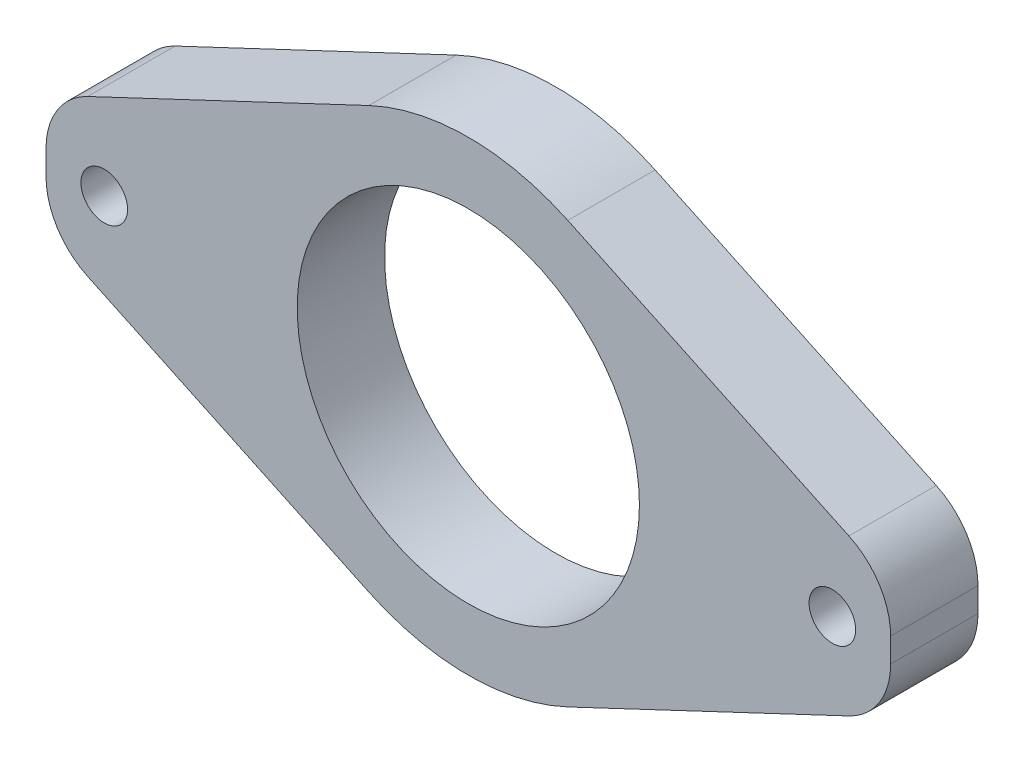
ISO-10303-21;
HEADER;
FILE_DESCRIPTION(('STEP AP214'),'2;1');
FILE_NAME('part.step','',(''),(''),'','','');
FILE_SCHEMA(('AUTOMOTIVE_DESIGN { 1 0 10303 214 1 1 1 1 }'));
ENDSEC;
DATA;
#1=APPLICATION_CONTEXT('core data for automotive mechanical design processes');
#2=APPLICATION_PROTOCOL_DEFINITION('international standard','automotive_design',2000,#1);
#3=PRODUCT_CONTEXT('',#1,'mechanical');
#4=PRODUCT('Part','Part','',(#3));
#5=PRODUCT_RELATED_PRODUCT_CATEGORY('part','',(#4));
#6=PRODUCT_DEFINITION_FORMATION('','',#4);
#7=PRODUCT_DEFINITION_CONTEXT('part definition',#1,'design');
#8=PRODUCT_DEFINITION('design','',#6,#7);
#9=PRODUCT_DEFINITION_SHAPE('','',#8);
#10=(LENGTH_UNIT() NAMED_UNIT(*) SI_UNIT(.MILLI.,.METRE.));
#11=(NAMED_UNIT(*) PLANE_ANGLE_UNIT() SI_UNIT($,.RADIAN.));
#12=(NAMED_UNIT(*) SI_UNIT($,.STERADIAN.) SOLID_ANGLE_UNIT());
#13=UNCERTAINTY_MEASURE_WITH_UNIT(LENGTH_MEASURE(1.E-05),#10,'distance_accuracy_value','');
#14=(GEOMETRIC_REPRESENTATION_CONTEXT(3) GLOBAL_UNCERTAINTY_ASSIGNED_CONTEXT((#13)) GLOBAL_UNIT_ASSIGNED_CONTEXT((#10,
#11,#12)) REPRESENTATION_CONTEXT('',''));
#15=CARTESIAN_POINT('',(0.,0.,0.));
#16=DIRECTION('',(0.,0.,1.));
#17=DIRECTION('',(1.,0.,0.));
#18=AXIS2_PLACEMENT_3D('',#15,#16,#17);
#19=CARTESIAN_POINT('',(0.,0.,6.));
#20=DIRECTION('',(0.,0.,-1.));
#21=DIRECTION('',(-1.,0.,0.));
#22=AXIS2_PLACEMENT_3D('',#19,#20,#21);
#23=CYLINDRICAL_SURFACE('',#22,16.);
#24=CARTESIAN_POINT('',(0.,0.,0.));
#25=DIRECTION('',(0.,0.,1.));
#26=DIRECTION('',(1.,0.,0.));
#27=AXIS2_PLACEMENT_3D('',#24,#25,#26);
#28=CIRCLE('',#27,16.);
#29=CARTESIAN_POINT('',(-6.83199616565601,14.4680277989939,0.));
#30=VERTEX_POINT('',#29);
#31=CARTESIAN_POINT('',(6.83199616565601,14.4680277989939,0.));
#32=VERTEX_POINT('',#31);
#33=EDGE_CURVE('E142',#30,#32,#28,.F.);
#34=ORIENTED_EDGE('',*,*,#33,.F.);
#35=DIRECTION('',(0.,0.,-1.));
#36=VECTOR('',#35,1.);
#37=CARTESIAN_POINT('',(-6.83199616565601,14.4680277989939,6.));
#38=LINE('',#37,#36);
#39=CARTESIAN_POINT('',(-6.83199616565601,14.4680277989939,6.));
#40=VERTEX_POINT('',#39);
#41=EDGE_CURVE('E130',#40,#30,#38,.T.);
#42=ORIENTED_EDGE('',*,*,#41,.F.);
#43=CARTESIAN_POINT('',(0.,0.,6.));
#44=DIRECTION('',(0.,0.,1.));
#45=DIRECTION('',(1.,0.,0.));
#46=AXIS2_PLACEMENT_3D('',#43,#44,#45);
#47=CIRCLE('',#46,16.);
#48=CARTESIAN_POINT('',(6.83199616565601,14.4680277989939,6.));
#49=VERTEX_POINT('',#48);
#50=EDGE_CURVE('E136',#40,#49,#47,.F.);
#51=ORIENTED_EDGE('',*,*,#50,.T.);
#52=DIRECTION('',(0.,0.,-1.));
#53=VECTOR('',#52,1.);
#54=CARTESIAN_POINT('',(6.83199616565601,14.4680277989939,6.));
#55=LINE('',#54,#53);
#56=EDGE_CURVE('E180',#49,#32,#55,.T.);
#57=ORIENTED_EDGE('',*,*,#56,.T.);
#58=EDGE_LOOP('',(#34,#42,#51,#57));
#59=FACE_BOUND('',#58,.T.);
#60=ADVANCED_FACE('F35',(#59),#23,.T.);
#61=CARTESIAN_POINT('',(-6.83199616565601,14.4680277989939,6.));
#62=DIRECTION('',(-0.4269997603535,0.904251737437122,0.));
#63=DIRECTION('',(-0.904251737437122,-0.426999760353501,0.));
#64=AXIS2_PLACEMENT_3D('',#61,#62,#63);
#65=PLANE('',#64);
#66=DIRECTION('',(0.904251737437122,0.426999760353501,0.));
#67=VECTOR('',#66,1.);
#68=CARTESIAN_POINT('',(-6.83199616565601,14.4680277989939,0.));
#69=LINE('',#68,#67);
#70=CARTESIAN_POINT('',(-26.1349988017675,5.35289187115644,0.));
#71=VERTEX_POINT('',#70);
#72=EDGE_CURVE('E182',#71,#30,#69,.T.);
#73=ORIENTED_EDGE('',*,*,#72,.F.);
#74=DIRECTION('',(0.,0.,-1.));
#75=VECTOR('',#74,1.);
#76=CARTESIAN_POINT('',(-26.1349988017675,5.35289187115644,6.));
#77=LINE('',#76,#75);
#78=CARTESIAN_POINT('',(-26.1349988017675,5.35289187115644,6.));
#79=VERTEX_POINT('',#78);
#80=EDGE_CURVE('E43',#71,#79,#77,.F.);
#81=ORIENTED_EDGE('',*,*,#80,.T.);
#82=DIRECTION('',(0.904251737437122,0.426999760353501,0.));
#83=VECTOR('',#82,1.);
#84=CARTESIAN_POINT('',(-6.83199616565601,14.4680277989939,6.));
#85=LINE('',#84,#83);
#86=EDGE_CURVE('E126',#79,#40,#85,.T.);
#87=ORIENTED_EDGE('',*,*,#86,.T.);
#88=ORIENTED_EDGE('',*,*,#41,.T.);
#89=EDGE_LOOP('',(#73,#81,#87,#88));
#90=FACE_BOUND('',#89,.T.);
#91=ADVANCED_FACE('F129',(#90),#65,.T.);
#92=CARTESIAN_POINT('',(-29.,0.,6.));
#93=DIRECTION('',(-1.,0.,0.));
#94=DIRECTION('',(0.,0.,1.));
#95=AXIS2_PLACEMENT_3D('',#92,#93,#94);
#96=PLANE('',#95);
#97=DIRECTION('',(0.,1.,0.));
#98=VECTOR('',#97,1.);
#99=CARTESIAN_POINT('',(-29.,0.,6.));
#100=LINE('',#99,#98);
#101=CARTESIAN_POINT('',(-29.,-0.831633183970833,6.));
#102=VERTEX_POINT('',#101);
#103=CARTESIAN_POINT('',(-29.,0.831633183970832,6.));
#104=VERTEX_POINT('',#103);
#105=EDGE_CURVE('E135',#102,#104,#100,.T.);
#106=ORIENTED_EDGE('',*,*,#105,.T.);
#107=DIRECTION('',(0.,0.,-1.));
#108=VECTOR('',#107,1.);
#109=CARTESIAN_POINT('',(-29.,0.831633183970832,6.));
#110=LINE('',#109,#108);
#111=CARTESIAN_POINT('',(-29.,0.831633183970832,0.));
#112=VERTEX_POINT('',#111);
#113=EDGE_CURVE('E235',#104,#112,#110,.T.);
#114=ORIENTED_EDGE('',*,*,#113,.T.);
#115=DIRECTION('',(0.,1.,0.));
#116=VECTOR('',#115,1.);
#117=CARTESIAN_POINT('',(-29.,0.,0.));
#118=LINE('',#117,#116);
#119=CARTESIAN_POINT('',(-29.,-0.831633183970833,0.));
#120=VERTEX_POINT('',#119);
#121=EDGE_CURVE('E184',#120,#112,#118,.T.);
#122=ORIENTED_EDGE('',*,*,#121,.F.);
#123=DIRECTION('',(0.,0.,-1.));
#124=VECTOR('',#123,1.);
#125=CARTESIAN_POINT('',(-29.,-0.831633183970833,6.));
#126=LINE('',#125,#124);
#127=EDGE_CURVE('E233',#120,#102,#126,.F.);
#128=ORIENTED_EDGE('',*,*,#127,.T.);
#129=EDGE_LOOP('',(#106,#114,#122,#128));
#130=FACE_BOUND('',#129,.T.);
#131=ADVANCED_FACE('F240',(#130),#96,.T.);
#132=CARTESIAN_POINT('',(-6.83199616565601,-14.4680277989939,6.));
#133=DIRECTION('',(0.4269997603535,0.904251737437122,0.));
#134=DIRECTION('',(-0.904251737437122,0.426999760353501,0.));
#135=AXIS2_PLACEMENT_3D('',#132,#133,#134);
#136=PLANE('',#135);
#137=DIRECTION('',(0.904251737437122,-0.426999760353501,0.));
#138=VECTOR('',#137,1.);
#139=CARTESIAN_POINT('',(-6.83199616565601,-14.4680277989939,6.));
#140=LINE('',#139,#138);
#141=CARTESIAN_POINT('',(-26.1349988017675,-5.35289187115644,6.));
#142=VERTEX_POINT('',#141);
#143=CARTESIAN_POINT('',(-6.83199616565601,-14.4680277989939,6.));
#144=VERTEX_POINT('',#143);
#145=EDGE_CURVE('E160',#142,#144,#140,.T.);
#146=ORIENTED_EDGE('',*,*,#145,.F.);
#147=DIRECTION('',(0.,0.,-1.));
#148=VECTOR('',#147,1.);
#149=CARTESIAN_POINT('',(-26.1349988017675,-5.35289187115644,0.));
#150=LINE('',#149,#148);
#151=CARTESIAN_POINT('',(-26.1349988017675,-5.35289187115644,0.));
#152=VERTEX_POINT('',#151);
#153=EDGE_CURVE('E11',#142,#152,#150,.T.);
#154=ORIENTED_EDGE('',*,*,#153,.T.);
#155=DIRECTION('',(0.904251737437122,-0.426999760353501,0.));
#156=VECTOR('',#155,1.);
#157=CARTESIAN_POINT('',(-6.83199616565601,-14.4680277989939,0.));
#158=LINE('',#157,#156);
#159=CARTESIAN_POINT('',(-6.83199616565601,-14.4680277989939,0.));
#160=VERTEX_POINT('',#159);
#161=EDGE_CURVE('E187',#152,#160,#158,.T.);
#162=ORIENTED_EDGE('',*,*,#161,.T.);
#163=DIRECTION('',(0.,0.,-1.));
#164=VECTOR('',#163,1.);
#165=CARTESIAN_POINT('',(-6.83199616565601,-14.4680277989939,6.));
#166=LINE('',#165,#164);
#167=EDGE_CURVE('E144',#144,#160,#166,.T.);
#168=ORIENTED_EDGE('',*,*,#167,.F.);
#169=EDGE_LOOP('',(#146,#154,#162,#168));
#170=FACE_BOUND('',#169,.T.);
#171=ADVANCED_FACE('F252',(#170),#136,.F.);
#172=CARTESIAN_POINT('',(0.,0.,6.));
#173=DIRECTION('',(0.,0.,-1.));
#174=DIRECTION('',(-1.,0.,0.));
#175=AXIS2_PLACEMENT_3D('',#172,#173,#174);
#176=CYLINDRICAL_SURFACE('',#175,16.);
#177=CARTESIAN_POINT('',(0.,0.,0.));
#178=DIRECTION('',(0.,0.,1.));
#179=DIRECTION('',(1.,0.,0.));
#180=AXIS2_PLACEMENT_3D('',#177,#178,#179);
#181=CIRCLE('',#180,16.);
#182=CARTESIAN_POINT('',(6.83199616565601,-14.4680277989939,0.));
#183=VERTEX_POINT('',#182);
#184=EDGE_CURVE('E189',#160,#183,#181,.T.);
#185=ORIENTED_EDGE('',*,*,#184,.T.);
#186=DIRECTION('',(0.,0.,-1.));
#187=VECTOR('',#186,1.);
#188=CARTESIAN_POINT('',(6.83199616565601,-14.4680277989939,6.));
#189=LINE('',#188,#187);
#190=CARTESIAN_POINT('',(6.83199616565601,-14.4680277989939,6.));
#191=VERTEX_POINT('',#190);
#192=EDGE_CURVE('E205',#191,#183,#189,.T.);
#193=ORIENTED_EDGE('',*,*,#192,.F.);
#194=CARTESIAN_POINT('',(0.,0.,6.));
#195=DIRECTION('',(0.,0.,1.));
#196=DIRECTION('',(1.,0.,0.));
#197=AXIS2_PLACEMENT_3D('',#194,#195,#196);
#198=CIRCLE('',#197,16.);
#199=EDGE_CURVE('E162',#144,#191,#198,.T.);
#200=ORIENTED_EDGE('',*,*,#199,.F.);
#201=ORIENTED_EDGE('',*,*,#167,.T.);
#202=EDGE_LOOP('',(#185,#193,#200,#201));
#203=FACE_BOUND('',#202,.T.);
#204=ADVANCED_FACE('F258',(#203),#176,.T.);
#205=CARTESIAN_POINT('',(6.83199616565601,-14.4680277989939,6.));
#206=DIRECTION('',(0.4269997603535,-0.904251737437122,0.));
#207=DIRECTION('',(0.904251737437122,0.426999760353501,0.));
#208=AXIS2_PLACEMENT_3D('',#205,#206,#207);
#209=PLANE('',#208);
#210=DIRECTION('',(-0.904251737437122,-0.426999760353501,0.));
#211=VECTOR('',#210,1.);
#212=CARTESIAN_POINT('',(6.83199616565601,-14.4680277989939,0.));
#213=LINE('',#212,#211);
#214=CARTESIAN_POINT('',(26.1349988017675,-5.35289187115644,0.));
#215=VERTEX_POINT('',#214);
#216=EDGE_CURVE('E192',#215,#183,#213,.T.);
#217=ORIENTED_EDGE('',*,*,#216,.F.);
#218=DIRECTION('',(0.,0.,-1.));
#219=VECTOR('',#218,1.);
#220=CARTESIAN_POINT('',(26.1349988017675,-5.35289187115644,6.));
#221=LINE('',#220,#219);
#222=CARTESIAN_POINT('',(26.1349988017675,-5.35289187115644,6.));
#223=VERTEX_POINT('',#222);
#224=EDGE_CURVE('E50',#215,#223,#221,.F.);
#225=ORIENTED_EDGE('',*,*,#224,.T.);
#226=DIRECTION('',(-0.904251737437122,-0.426999760353501,0.));
#227=VECTOR('',#226,1.);
#228=CARTESIAN_POINT('',(6.83199616565601,-14.4680277989939,6.));
#229=LINE('',#228,#227);
#230=EDGE_CURVE('E165',#223,#191,#229,.T.);
#231=ORIENTED_EDGE('',*,*,#230,.T.);
#232=ORIENTED_EDGE('',*,*,#192,.T.);
#233=EDGE_LOOP('',(#217,#225,#231,#232));
#234=FACE_BOUND('',#233,.T.);
#235=ADVANCED_FACE('F259',(#234),#209,.T.);
#236=CARTESIAN_POINT('',(29.,0.,6.));
#237=DIRECTION('',(1.,0.,0.));
#238=DIRECTION('',(0.,0.,-1.));
#239=AXIS2_PLACEMENT_3D('',#236,#237,#238);
#240=PLANE('',#239);
#241=DIRECTION('',(0.,-1.,0.));
#242=VECTOR('',#241,1.);
#243=CARTESIAN_POINT('',(29.,0.,0.));
#244=LINE('',#243,#242);
#245=CARTESIAN_POINT('',(29.,0.831633183970833,0.));
#246=VERTEX_POINT('',#245);
#247=CARTESIAN_POINT('',(29.,-0.831633183970832,0.));
#248=VERTEX_POINT('',#247);
#249=EDGE_CURVE('E194',#246,#248,#244,.T.);
#250=ORIENTED_EDGE('',*,*,#249,.F.);
#251=DIRECTION('',(0.,0.,-1.));
#252=VECTOR('',#251,1.);
#253=CARTESIAN_POINT('',(29.,0.831633183970833,6.));
#254=LINE('',#253,#252);
#255=CARTESIAN_POINT('',(29.,0.831633183970833,6.));
#256=VERTEX_POINT('',#255);
#257=EDGE_CURVE('E223',#246,#256,#254,.F.);
#258=ORIENTED_EDGE('',*,*,#257,.T.);
#259=DIRECTION('',(0.,-1.,0.));
#260=VECTOR('',#259,1.);
#261=CARTESIAN_POINT('',(29.,0.,6.));
#262=LINE('',#261,#260);
#263=CARTESIAN_POINT('',(29.,-0.831633183970832,6.));
#264=VERTEX_POINT('',#263);
#265=EDGE_CURVE('E167',#256,#264,#262,.T.);
#266=ORIENTED_EDGE('',*,*,#265,.T.);
#267=DIRECTION('',(0.,0.,-1.));
#268=VECTOR('',#267,1.);
#269=CARTESIAN_POINT('',(29.,-0.831633183970832,6.));
#270=LINE('',#269,#268);
#271=EDGE_CURVE('E220',#264,#248,#270,.T.);
#272=ORIENTED_EDGE('',*,*,#271,.T.);
#273=EDGE_LOOP('',(#250,#258,#266,#272));
#274=FACE_BOUND('',#273,.T.);
#275=ADVANCED_FACE('F266',(#274),#240,.T.);
#276=CARTESIAN_POINT('',(-25.,0.,6.));
#277=DIRECTION('',(0.,0.,-1.));
#278=DIRECTION('',(-1.,0.,0.));
#279=AXIS2_PLACEMENT_3D('',#276,#277,#278);
#280=CYLINDRICAL_SURFACE('',#279,1.6);
#281=CARTESIAN_POINT('',(-25.,0.,6.));
#282=DIRECTION('',(0.,0.,1.));
#283=DIRECTION('',(1.,0.,0.));
#284=AXIS2_PLACEMENT_3D('',#281,#282,#283);
#285=CIRCLE('',#284,1.6);
#286=CARTESIAN_POINT('',(-23.4,0.,6.));
#287=VERTEX_POINT('',#286);
#288=EDGE_CURVE('E174',#287,#287,#285,.T.);
#289=ORIENTED_EDGE('',*,*,#288,.T.);
#290=EDGE_LOOP('',(#289));
#291=FACE_BOUND('',#290,.T.);
#292=CARTESIAN_POINT('',(-25.,0.,0.));
#293=DIRECTION('',(0.,0.,1.));
#294=DIRECTION('',(1.,0.,0.));
#295=AXIS2_PLACEMENT_3D('',#292,#293,#294);
#296=CIRCLE('',#295,1.6);
#297=CARTESIAN_POINT('',(-23.4,0.,0.));
#298=VERTEX_POINT('',#297);
#299=EDGE_CURVE('E155',#298,#298,#296,.T.);
#300=ORIENTED_EDGE('',*,*,#299,.F.);
#301=EDGE_LOOP('',(#300));
#302=FACE_BOUND('',#301,.T.);
#303=ADVANCED_FACE('F302',(#291,#302),#280,.F.);
#304=CARTESIAN_POINT('',(0.,0.,6.));
#305=DIRECTION('',(0.,0.,-1.));
#306=DIRECTION('',(-1.,0.,0.));
#307=AXIS2_PLACEMENT_3D('',#304,#305,#306);
#308=CYLINDRICAL_SURFACE('',#307,11.75);
#309=CARTESIAN_POINT('',(0.,0.,6.));
#310=DIRECTION('',(0.,0.,1.));
#311=DIRECTION('',(1.,0.,0.));
#312=AXIS2_PLACEMENT_3D('',#309,#310,#311);
#313=CIRCLE('',#312,11.75);
#314=CARTESIAN_POINT('',(11.75,0.,6.));
#315=VERTEX_POINT('',#314);
#316=EDGE_CURVE('E171',#315,#315,#313,.T.);
#317=ORIENTED_EDGE('',*,*,#316,.T.);
#318=EDGE_LOOP('',(#317));
#319=FACE_BOUND('',#318,.T.);
#320=CARTESIAN_POINT('',(0.,0.,0.));
#321=DIRECTION('',(0.,0.,1.));
#322=DIRECTION('',(1.,0.,0.));
#323=AXIS2_PLACEMENT_3D('',#320,#321,#322);
#324=CIRCLE('',#323,11.75);
#325=CARTESIAN_POINT('',(11.75,0.,0.));
#326=VERTEX_POINT('',#325);
#327=EDGE_CURVE('E199',#326,#326,#324,.T.);
#328=ORIENTED_EDGE('',*,*,#327,.F.);
#329=EDGE_LOOP('',(#328));
#330=FACE_BOUND('',#329,.T.);
#331=ADVANCED_FACE('F305',(#319,#330),#308,.F.);
#332=CARTESIAN_POINT('',(6.83199616565601,14.4680277989939,6.));
#333=DIRECTION('',(-0.4269997603535,-0.904251737437122,0.));
#334=DIRECTION('',(0.904251737437122,-0.426999760353501,0.));
#335=AXIS2_PLACEMENT_3D('',#332,#333,#334);
#336=PLANE('',#335);
#337=DIRECTION('',(-0.904251737437122,0.426999760353501,0.));
#338=VECTOR('',#337,1.);
#339=CARTESIAN_POINT('',(6.83199616565601,14.4680277989939,6.));
#340=LINE('',#339,#338);
#341=CARTESIAN_POINT('',(26.1349988017675,5.35289187115644,6.));
#342=VERTEX_POINT('',#341);
#343=EDGE_CURVE('E150',#342,#49,#340,.T.);
#344=ORIENTED_EDGE('',*,*,#343,.F.);
#345=DIRECTION('',(0.,0.,-1.));
#346=VECTOR('',#345,1.);
#347=CARTESIAN_POINT('',(26.1349988017675,5.35289187115644,0.));
#348=LINE('',#347,#346);
#349=CARTESIAN_POINT('',(26.1349988017675,5.35289187115644,0.));
#350=VERTEX_POINT('',#349);
#351=EDGE_CURVE('E143',#342,#350,#348,.T.);
#352=ORIENTED_EDGE('',*,*,#351,.T.);
#353=DIRECTION('',(-0.904251737437122,0.426999760353501,0.));
#354=VECTOR('',#353,1.);
#355=CARTESIAN_POINT('',(6.83199616565601,14.4680277989939,0.));
#356=LINE('',#355,#354);
#357=EDGE_CURVE('E197',#350,#32,#356,.T.);
#358=ORIENTED_EDGE('',*,*,#357,.T.);
#359=ORIENTED_EDGE('',*,*,#56,.F.);
#360=EDGE_LOOP('',(#344,#352,#358,#359));
#361=FACE_BOUND('',#360,.T.);
#362=ADVANCED_FACE('F272',(#361),#336,.F.);
#363=CARTESIAN_POINT('',(25.,0.,6.));
#364=DIRECTION('',(0.,0.,-1.));
#365=DIRECTION('',(-1.,0.,0.));
#366=AXIS2_PLACEMENT_3D('',#363,#364,#365);
#367=CYLINDRICAL_SURFACE('',#366,1.6);
#368=CARTESIAN_POINT('',(25.,0.,6.));
#369=DIRECTION('',(0.,0.,1.));
#370=DIRECTION('',(1.,0.,0.));
#371=AXIS2_PLACEMENT_3D('',#368,#369,#370);
#372=CIRCLE('',#371,1.6);
#373=CARTESIAN_POINT('',(26.6,0.,6.));
#374=VERTEX_POINT('',#373);
#375=EDGE_CURVE('E177',#374,#374,#372,.T.);
#376=ORIENTED_EDGE('',*,*,#375,.T.);
#377=EDGE_LOOP('',(#376));
#378=FACE_BOUND('',#377,.T.);
#379=CARTESIAN_POINT('',(25.,0.,0.));
#380=DIRECTION('',(0.,0.,1.));
#381=DIRECTION('',(1.,0.,0.));
#382=AXIS2_PLACEMENT_3D('',#379,#380,#381);
#383=CIRCLE('',#382,1.6);
#384=CARTESIAN_POINT('',(26.6,0.,0.));
#385=VERTEX_POINT('',#384);
#386=EDGE_CURVE('E152',#385,#385,#383,.T.);
#387=ORIENTED_EDGE('',*,*,#386,.F.);
#388=EDGE_LOOP('',(#387));
#389=FACE_BOUND('',#388,.T.);
#390=ADVANCED_FACE('F296',(#378,#389),#367,.F.);
#391=CARTESIAN_POINT('',(0.,0.,6.));
#392=DIRECTION('',(0.,0.,1.));
#393=DIRECTION('',(1.,0.,0.));
#394=AXIS2_PLACEMENT_3D('',#391,#392,#393);
#395=PLANE('',#394);
#396=ORIENTED_EDGE('',*,*,#265,.F.);
#397=CARTESIAN_POINT('',(24.,0.831633183970833,6.));
#398=DIRECTION('',(0.,0.,1.));
#399=DIRECTION('',(1.,0.,0.));
#400=AXIS2_PLACEMENT_3D('',#397,#398,#399);
#401=CIRCLE('',#400,5.);
#402=EDGE_CURVE('E230',#256,#342,#401,.T.);
#403=ORIENTED_EDGE('',*,*,#402,.T.);
#404=ORIENTED_EDGE('',*,*,#343,.T.);
#405=ORIENTED_EDGE('',*,*,#50,.F.);
#406=ORIENTED_EDGE('',*,*,#86,.F.);
#407=CARTESIAN_POINT('',(-24.,0.831633183970832,6.));
#408=DIRECTION('',(0.,0.,1.));
#409=DIRECTION('',(1.,0.,0.));
#410=AXIS2_PLACEMENT_3D('',#407,#408,#409);
#411=CIRCLE('',#410,5.);
#412=EDGE_CURVE('E226',#79,#104,#411,.T.);
#413=ORIENTED_EDGE('',*,*,#412,.T.);
#414=ORIENTED_EDGE('',*,*,#105,.F.);
#415=CARTESIAN_POINT('',(-24.,-0.831633183970833,6.));
#416=DIRECTION('',(0.,0.,1.));
#417=DIRECTION('',(1.,0.,0.));
#418=AXIS2_PLACEMENT_3D('',#415,#416,#417);
#419=CIRCLE('',#418,5.);
#420=EDGE_CURVE('E58',#102,#142,#419,.T.);
#421=ORIENTED_EDGE('',*,*,#420,.T.);
#422=ORIENTED_EDGE('',*,*,#145,.T.);
#423=ORIENTED_EDGE('',*,*,#199,.T.);
#424=ORIENTED_EDGE('',*,*,#230,.F.);
#425=CARTESIAN_POINT('',(24.,-0.831633183970832,6.));
#426=DIRECTION('',(0.,0.,1.));
#427=DIRECTION('',(1.,0.,0.));
#428=AXIS2_PLACEMENT_3D('',#425,#426,#427);
#429=CIRCLE('',#428,5.);
#430=EDGE_CURVE('E228',#223,#264,#429,.T.);
#431=ORIENTED_EDGE('',*,*,#430,.T.);
#432=EDGE_LOOP('',(#396,#403,#404,#405,#406,#413,#414,#421,#422,#423,#424,#431));
#433=FACE_BOUND('',#432,.T.);
#434=ORIENTED_EDGE('',*,*,#316,.F.);
#435=EDGE_LOOP('',(#434));
#436=FACE_BOUND('',#435,.T.);
#437=ORIENTED_EDGE('',*,*,#288,.F.);
#438=EDGE_LOOP('',(#437));
#439=FACE_BOUND('',#438,.T.);
#440=ORIENTED_EDGE('',*,*,#375,.F.);
#441=EDGE_LOOP('',(#440));
#442=FACE_BOUND('',#441,.T.);
#443=ADVANCED_FACE('F147',(#433,#436,#439,#442),#395,.T.);
#444=CARTESIAN_POINT('',(0.,0.,0.));
#445=DIRECTION('',(0.,0.,1.));
#446=DIRECTION('',(1.,0.,0.));
#447=AXIS2_PLACEMENT_3D('',#444,#445,#446);
#448=PLANE('',#447);
#449=ORIENTED_EDGE('',*,*,#357,.F.);
#450=CARTESIAN_POINT('',(24.,0.831633183970833,0.));
#451=DIRECTION('',(0.,0.,1.));
#452=DIRECTION('',(1.,0.,0.));
#453=AXIS2_PLACEMENT_3D('',#450,#451,#452);
#454=CIRCLE('',#453,5.);
#455=EDGE_CURVE('E218',#350,#246,#454,.F.);
#456=ORIENTED_EDGE('',*,*,#455,.T.);
#457=ORIENTED_EDGE('',*,*,#249,.T.);
#458=CARTESIAN_POINT('',(24.,-0.831633183970832,0.));
#459=DIRECTION('',(0.,0.,1.));
#460=DIRECTION('',(1.,0.,0.));
#461=AXIS2_PLACEMENT_3D('',#458,#459,#460);
#462=CIRCLE('',#461,5.);
#463=EDGE_CURVE('E216',#248,#215,#462,.F.);
#464=ORIENTED_EDGE('',*,*,#463,.T.);
#465=ORIENTED_EDGE('',*,*,#216,.T.);
#466=ORIENTED_EDGE('',*,*,#184,.F.);
#467=ORIENTED_EDGE('',*,*,#161,.F.);
#468=CARTESIAN_POINT('',(-24.,-0.831633183970833,0.));
#469=DIRECTION('',(0.,0.,1.));
#470=DIRECTION('',(1.,0.,0.));
#471=AXIS2_PLACEMENT_3D('',#468,#469,#470);
#472=CIRCLE('',#471,5.);
#473=EDGE_CURVE('E212',#152,#120,#472,.F.);
#474=ORIENTED_EDGE('',*,*,#473,.T.);
#475=ORIENTED_EDGE('',*,*,#121,.T.);
#476=CARTESIAN_POINT('',(-24.,0.831633183970832,0.));
#477=DIRECTION('',(0.,0.,1.));
#478=DIRECTION('',(1.,0.,0.));
#479=AXIS2_PLACEMENT_3D('',#476,#477,#478);
#480=CIRCLE('',#479,5.);
#481=EDGE_CURVE('E214',#112,#71,#480,.F.);
#482=ORIENTED_EDGE('',*,*,#481,.T.);
#483=ORIENTED_EDGE('',*,*,#72,.T.);
#484=ORIENTED_EDGE('',*,*,#33,.T.);
#485=EDGE_LOOP('',(#449,#456,#457,#464,#465,#466,#467,#474,#475,#482,#483,#484));
#486=FACE_BOUND('',#485,.T.);
#487=ORIENTED_EDGE('',*,*,#327,.T.);
#488=EDGE_LOOP('',(#487));
#489=FACE_BOUND('',#488,.T.);
#490=ORIENTED_EDGE('',*,*,#299,.T.);
#491=EDGE_LOOP('',(#490));
#492=FACE_BOUND('',#491,.T.);
#493=ORIENTED_EDGE('',*,*,#386,.T.);
#494=EDGE_LOOP('',(#493));
#495=FACE_BOUND('',#494,.T.);
#496=ADVANCED_FACE('F245',(#486,#489,#492,#495),#448,.F.);
#497=CARTESIAN_POINT('',(24.,0.831633183970833,6.));
#498=DIRECTION('',(0.,0.,1.));
#499=DIRECTION('',(1.,0.,0.));
#500=AXIS2_PLACEMENT_3D('',#497,#498,#499);
#501=CYLINDRICAL_SURFACE('',#500,5.);
#502=ORIENTED_EDGE('',*,*,#402,.F.);
#503=ORIENTED_EDGE('',*,*,#257,.F.);
#504=ORIENTED_EDGE('',*,*,#455,.F.);
#505=ORIENTED_EDGE('',*,*,#351,.F.);
#506=EDGE_LOOP('',(#502,#503,#504,#505));
#507=FACE_BOUND('',#506,.T.);
#508=ADVANCED_FACE('F269',(#507),#501,.T.);
#509=CARTESIAN_POINT('',(24.,-0.831633183970832,6.));
#510=DIRECTION('',(0.,0.,-1.));
#511=DIRECTION('',(-1.,0.,0.));
#512=AXIS2_PLACEMENT_3D('',#509,#510,#511);
#513=CYLINDRICAL_SURFACE('',#512,5.);
#514=ORIENTED_EDGE('',*,*,#430,.F.);
#515=ORIENTED_EDGE('',*,*,#224,.F.);
#516=ORIENTED_EDGE('',*,*,#463,.F.);
#517=ORIENTED_EDGE('',*,*,#271,.F.);
#518=EDGE_LOOP('',(#514,#515,#516,#517));
#519=FACE_BOUND('',#518,.T.);
#520=ADVANCED_FACE('F261',(#519),#513,.T.);
#521=CARTESIAN_POINT('',(-24.,0.831633183970832,6.));
#522=DIRECTION('',(0.,0.,-1.));
#523=DIRECTION('',(-1.,0.,0.));
#524=AXIS2_PLACEMENT_3D('',#521,#522,#523);
#525=CYLINDRICAL_SURFACE('',#524,5.);
#526=ORIENTED_EDGE('',*,*,#412,.F.);
#527=ORIENTED_EDGE('',*,*,#80,.F.);
#528=ORIENTED_EDGE('',*,*,#481,.F.);
#529=ORIENTED_EDGE('',*,*,#113,.F.);
#530=EDGE_LOOP('',(#526,#527,#528,#529));
#531=FACE_BOUND('',#530,.T.);
#532=ADVANCED_FACE('F273',(#531),#525,.T.);
#533=CARTESIAN_POINT('',(-24.,-0.831633183970833,6.));
#534=DIRECTION('',(0.,0.,1.));
#535=DIRECTION('',(1.,0.,0.));
#536=AXIS2_PLACEMENT_3D('',#533,#534,#535);
#537=CYLINDRICAL_SURFACE('',#536,5.);
#538=ORIENTED_EDGE('',*,*,#420,.F.);
#539=ORIENTED_EDGE('',*,*,#127,.F.);
#540=ORIENTED_EDGE('',*,*,#473,.F.);
#541=ORIENTED_EDGE('',*,*,#153,.F.);
#542=EDGE_LOOP('',(#538,#539,#540,#541));
#543=FACE_BOUND('',#542,.T.);
#544=ADVANCED_FACE('F37',(#543),#537,.T.);
#545=CLOSED_SHELL('',(#60,#91,#131,#171,#204,#235,#275,#303,#331,#362,#390,#443,#496,#508,#520,
#532,#544));
#546=MANIFOLD_SOLID_BREP('B2',#545);
#547=ADVANCED_BREP_SHAPE_REPRESENTATION('',(#18,#546),#14);
#548=SHAPE_DEFINITION_REPRESENTATION(#9,#547);
ENDSEC;
END-ISO-10303-21;
